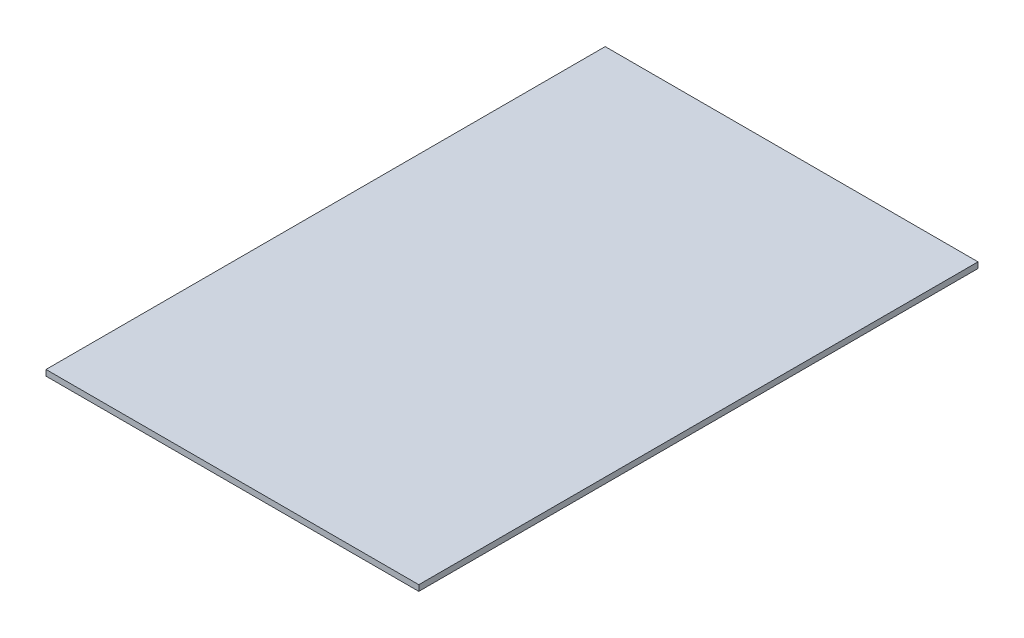
ISO-10303-21;
HEADER;
FILE_DESCRIPTION(('STEP AP214'),'2;1');
FILE_NAME('part.step','',(''),(''),'','','');
FILE_SCHEMA(('AUTOMOTIVE_DESIGN { 1 0 10303 214 1 1 1 1 }'));
ENDSEC;
DATA;
#1=APPLICATION_CONTEXT('core data for automotive mechanical design processes');
#2=APPLICATION_PROTOCOL_DEFINITION('international standard','automotive_design',2000,#1);
#3=PRODUCT_CONTEXT('',#1,'mechanical');
#4=PRODUCT('Part','Part','',(#3));
#5=PRODUCT_RELATED_PRODUCT_CATEGORY('part','',(#4));
#6=PRODUCT_DEFINITION_FORMATION('','',#4);
#7=PRODUCT_DEFINITION_CONTEXT('part definition',#1,'design');
#8=PRODUCT_DEFINITION('design','',#6,#7);
#9=PRODUCT_DEFINITION_SHAPE('','',#8);
#10=(LENGTH_UNIT() NAMED_UNIT(*) SI_UNIT(.MILLI.,.METRE.));
#11=(NAMED_UNIT(*) PLANE_ANGLE_UNIT() SI_UNIT($,.RADIAN.));
#12=(NAMED_UNIT(*) SI_UNIT($,.STERADIAN.) SOLID_ANGLE_UNIT());
#13=UNCERTAINTY_MEASURE_WITH_UNIT(LENGTH_MEASURE(1.E-05),#10,'distance_accuracy_value','');
#14=(GEOMETRIC_REPRESENTATION_CONTEXT(3) GLOBAL_UNCERTAINTY_ASSIGNED_CONTEXT((#13)) GLOBAL_UNIT_ASSIGNED_CONTEXT((#10,
#11,#12)) REPRESENTATION_CONTEXT('',''));
#15=CARTESIAN_POINT('',(0.,0.,0.));
#16=DIRECTION('',(0.,0.,1.));
#17=DIRECTION('',(1.,0.,0.));
#18=AXIS2_PLACEMENT_3D('',#15,#16,#17);
#19=CARTESIAN_POINT('',(609.6,-19.05,914.4));
#20=DIRECTION('',(1.,0.,0.));
#21=DIRECTION('',(0.,0.,-1.));
#22=AXIS2_PLACEMENT_3D('',#19,#20,#21);
#23=PLANE('',#22);
#24=DIRECTION('',(0.,0.,-1.));
#25=VECTOR('',#24,1.);
#26=CARTESIAN_POINT('',(609.6,0.,914.4));
#27=LINE('',#26,#25);
#28=CARTESIAN_POINT('',(609.6,0.,914.4));
#29=VERTEX_POINT('',#28);
#30=CARTESIAN_POINT('',(609.6,0.,-914.4));
#31=VERTEX_POINT('',#30);
#32=EDGE_CURVE('E115',#29,#31,#27,.T.);
#33=ORIENTED_EDGE('',*,*,#32,.F.);
#34=DIRECTION('',(0.,1.,0.));
#35=VECTOR('',#34,1.);
#36=CARTESIAN_POINT('',(609.6,-19.05,914.4));
#37=LINE('',#36,#35);
#38=CARTESIAN_POINT('',(609.6,-19.05,914.4));
#39=VERTEX_POINT('',#38);
#40=EDGE_CURVE('E11',#39,#29,#37,.T.);
#41=ORIENTED_EDGE('',*,*,#40,.F.);
#42=DIRECTION('',(0.,0.,-1.));
#43=VECTOR('',#42,1.);
#44=CARTESIAN_POINT('',(609.6,-19.05,914.4));
#45=LINE('',#44,#43);
#46=CARTESIAN_POINT('',(609.6,-19.05,-914.4));
#47=VERTEX_POINT('',#46);
#48=EDGE_CURVE('E107',#39,#47,#45,.T.);
#49=ORIENTED_EDGE('',*,*,#48,.T.);
#50=DIRECTION('',(0.,1.,0.));
#51=VECTOR('',#50,1.);
#52=CARTESIAN_POINT('',(609.6,-19.05,-914.4));
#53=LINE('',#52,#51);
#54=EDGE_CURVE('E48',#47,#31,#53,.T.);
#55=ORIENTED_EDGE('',*,*,#54,.T.);
#56=EDGE_LOOP('',(#33,#41,#49,#55));
#57=FACE_BOUND('',#56,.T.);
#58=ADVANCED_FACE('F45',(#57),#23,.T.);
#59=CARTESIAN_POINT('',(-609.6,-19.05,914.4));
#60=DIRECTION('',(0.,0.,1.));
#61=DIRECTION('',(1.,0.,0.));
#62=AXIS2_PLACEMENT_3D('',#59,#60,#61);
#63=PLANE('',#62);
#64=DIRECTION('',(1.,0.,0.));
#65=VECTOR('',#64,1.);
#66=CARTESIAN_POINT('',(-609.6,0.,914.4));
#67=LINE('',#66,#65);
#68=CARTESIAN_POINT('',(-609.6,0.,914.4));
#69=VERTEX_POINT('',#68);
#70=EDGE_CURVE('E110',#69,#29,#67,.T.);
#71=ORIENTED_EDGE('',*,*,#70,.F.);
#72=DIRECTION('',(0.,1.,0.));
#73=VECTOR('',#72,1.);
#74=CARTESIAN_POINT('',(-609.6,-19.05,914.4));
#75=LINE('',#74,#73);
#76=CARTESIAN_POINT('',(-609.6,-19.05,914.4));
#77=VERTEX_POINT('',#76);
#78=EDGE_CURVE('E55',#77,#69,#75,.T.);
#79=ORIENTED_EDGE('',*,*,#78,.F.);
#80=DIRECTION('',(1.,0.,0.));
#81=VECTOR('',#80,1.);
#82=CARTESIAN_POINT('',(-609.6,-19.05,914.4));
#83=LINE('',#82,#81);
#84=EDGE_CURVE('E102',#77,#39,#83,.T.);
#85=ORIENTED_EDGE('',*,*,#84,.T.);
#86=ORIENTED_EDGE('',*,*,#40,.T.);
#87=EDGE_LOOP('',(#71,#79,#85,#86));
#88=FACE_BOUND('',#87,.T.);
#89=ADVANCED_FACE('F131',(#88),#63,.T.);
#90=CARTESIAN_POINT('',(-609.6,-19.05,914.4));
#91=DIRECTION('',(-1.,0.,0.));
#92=DIRECTION('',(0.,0.,1.));
#93=AXIS2_PLACEMENT_3D('',#90,#91,#92);
#94=PLANE('',#93);
#95=DIRECTION('',(0.,0.,1.));
#96=VECTOR('',#95,1.);
#97=CARTESIAN_POINT('',(-609.6,0.,914.4));
#98=LINE('',#97,#96);
#99=CARTESIAN_POINT('',(-609.6,0.,-914.4));
#100=VERTEX_POINT('',#99);
#101=EDGE_CURVE('E96',#100,#69,#98,.T.);
#102=ORIENTED_EDGE('',*,*,#101,.F.);
#103=DIRECTION('',(0.,1.,0.));
#104=VECTOR('',#103,1.);
#105=CARTESIAN_POINT('',(-609.6,-19.05,-914.4));
#106=LINE('',#105,#104);
#107=CARTESIAN_POINT('',(-609.6,-19.05,-914.4));
#108=VERTEX_POINT('',#107);
#109=EDGE_CURVE('E91',#108,#100,#106,.T.);
#110=ORIENTED_EDGE('',*,*,#109,.F.);
#111=DIRECTION('',(0.,0.,1.));
#112=VECTOR('',#111,1.);
#113=CARTESIAN_POINT('',(-609.6,-19.05,914.4));
#114=LINE('',#113,#112);
#115=EDGE_CURVE('E94',#108,#77,#114,.T.);
#116=ORIENTED_EDGE('',*,*,#115,.T.);
#117=ORIENTED_EDGE('',*,*,#78,.T.);
#118=EDGE_LOOP('',(#102,#110,#116,#117));
#119=FACE_BOUND('',#118,.T.);
#120=ADVANCED_FACE('F93',(#119),#94,.T.);
#121=CARTESIAN_POINT('',(-609.6,-19.05,-914.4));
#122=DIRECTION('',(0.,0.,-1.));
#123=DIRECTION('',(-1.,0.,0.));
#124=AXIS2_PLACEMENT_3D('',#121,#122,#123);
#125=PLANE('',#124);
#126=DIRECTION('',(-1.,0.,0.));
#127=VECTOR('',#126,1.);
#128=CARTESIAN_POINT('',(-609.6,0.,-914.4));
#129=LINE('',#128,#127);
#130=EDGE_CURVE('E119',#31,#100,#129,.T.);
#131=ORIENTED_EDGE('',*,*,#130,.F.);
#132=ORIENTED_EDGE('',*,*,#54,.F.);
#133=DIRECTION('',(-1.,0.,0.));
#134=VECTOR('',#133,1.);
#135=CARTESIAN_POINT('',(-609.6,-19.05,-914.4));
#136=LINE('',#135,#134);
#137=EDGE_CURVE('E101',#47,#108,#136,.T.);
#138=ORIENTED_EDGE('',*,*,#137,.T.);
#139=ORIENTED_EDGE('',*,*,#109,.T.);
#140=EDGE_LOOP('',(#131,#132,#138,#139));
#141=FACE_BOUND('',#140,.T.);
#142=ADVANCED_FACE('F105',(#141),#125,.T.);
#143=CARTESIAN_POINT('',(0.,-19.05,0.));
#144=DIRECTION('',(0.,-1.,0.));
#145=DIRECTION('',(0.,0.,-1.));
#146=AXIS2_PLACEMENT_3D('',#143,#144,#145);
#147=PLANE('',#146);
#148=ORIENTED_EDGE('',*,*,#48,.F.);
#149=ORIENTED_EDGE('',*,*,#84,.F.);
#150=ORIENTED_EDGE('',*,*,#115,.F.);
#151=ORIENTED_EDGE('',*,*,#137,.F.);
#152=EDGE_LOOP('',(#148,#149,#150,#151));
#153=FACE_BOUND('',#152,.T.);
#154=ADVANCED_FACE('F100',(#153),#147,.T.);
#155=CARTESIAN_POINT('',(0.,0.,0.));
#156=DIRECTION('',(0.,-1.,0.));
#157=DIRECTION('',(0.,0.,-1.));
#158=AXIS2_PLACEMENT_3D('',#155,#156,#157);
#159=PLANE('',#158);
#160=ORIENTED_EDGE('',*,*,#32,.T.);
#161=ORIENTED_EDGE('',*,*,#130,.T.);
#162=ORIENTED_EDGE('',*,*,#101,.T.);
#163=ORIENTED_EDGE('',*,*,#70,.T.);
#164=EDGE_LOOP('',(#160,#161,#162,#163));
#165=FACE_BOUND('',#164,.T.);
#166=ADVANCED_FACE('F130',(#165),#159,.F.);
#167=CLOSED_SHELL('',(#58,#89,#120,#142,#154,#166));
#168=MANIFOLD_SOLID_BREP('B2',#167);
#169=ADVANCED_BREP_SHAPE_REPRESENTATION('',(#18,#168),#14);
#170=SHAPE_DEFINITION_REPRESENTATION(#9,#169);
ENDSEC;
END-ISO-10303-21;
